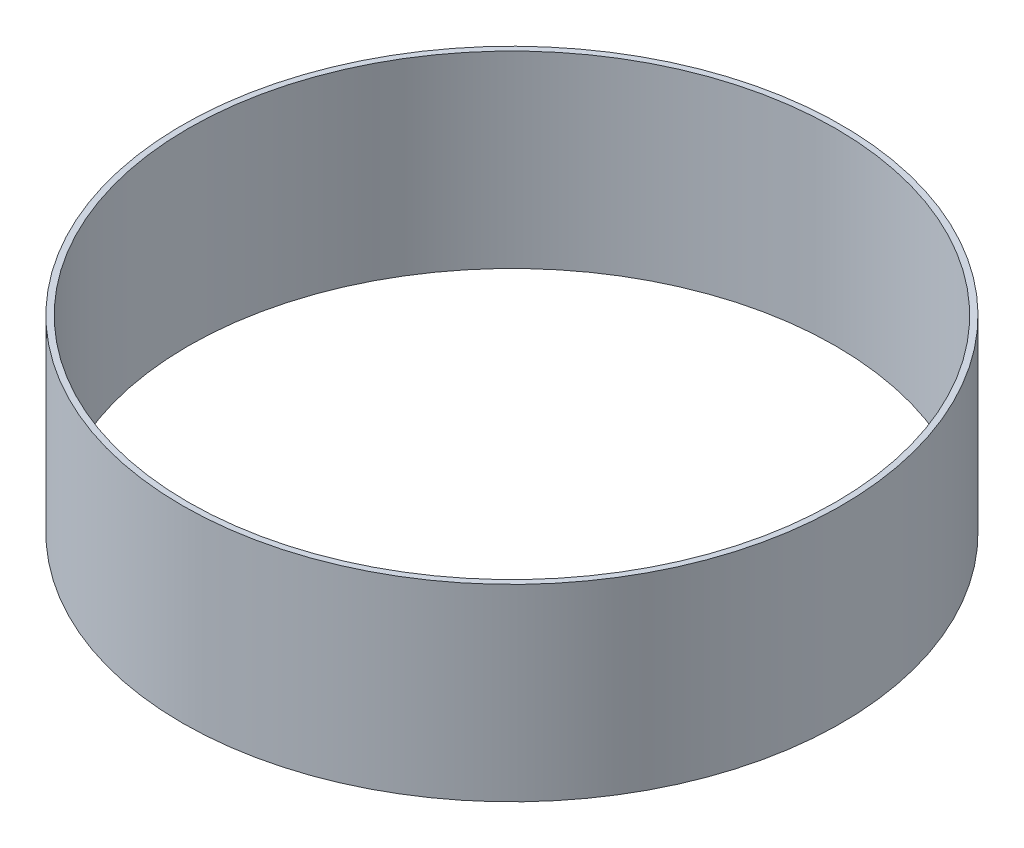
ISO-10303-21;
HEADER;
FILE_DESCRIPTION(('STEP AP214'),'2;1');
FILE_NAME('part.step','',(''),(''),'','','');
FILE_SCHEMA(('AUTOMOTIVE_DESIGN { 1 0 10303 214 1 1 1 1 }'));
ENDSEC;
DATA;
#1=APPLICATION_CONTEXT('core data for automotive mechanical design processes');
#2=APPLICATION_PROTOCOL_DEFINITION('international standard','automotive_design',2000,#1);
#3=PRODUCT_CONTEXT('',#1,'mechanical');
#4=PRODUCT('Part','Part','',(#3));
#5=PRODUCT_RELATED_PRODUCT_CATEGORY('part','',(#4));
#6=PRODUCT_DEFINITION_FORMATION('','',#4);
#7=PRODUCT_DEFINITION_CONTEXT('part definition',#1,'design');
#8=PRODUCT_DEFINITION('design','',#6,#7);
#9=PRODUCT_DEFINITION_SHAPE('','',#8);
#10=(LENGTH_UNIT() NAMED_UNIT(*) SI_UNIT(.MILLI.,.METRE.));
#11=(NAMED_UNIT(*) PLANE_ANGLE_UNIT() SI_UNIT($,.RADIAN.));
#12=(NAMED_UNIT(*) SI_UNIT($,.STERADIAN.) SOLID_ANGLE_UNIT());
#13=UNCERTAINTY_MEASURE_WITH_UNIT(LENGTH_MEASURE(1.E-05),#10,'distance_accuracy_value','');
#14=(GEOMETRIC_REPRESENTATION_CONTEXT(3) GLOBAL_UNCERTAINTY_ASSIGNED_CONTEXT((#13)) GLOBAL_UNIT_ASSIGNED_CONTEXT((#10,
#11,#12)) REPRESENTATION_CONTEXT('',''));
#15=CARTESIAN_POINT('',(0.,0.,0.));
#16=DIRECTION('',(0.,0.,1.));
#17=DIRECTION('',(1.,0.,0.));
#18=AXIS2_PLACEMENT_3D('',#15,#16,#17);
#19=CARTESIAN_POINT('',(0.,101.6,0.));
#20=DIRECTION('',(0.,1.,0.));
#21=DIRECTION('',(0.,0.,1.));
#22=AXIS2_PLACEMENT_3D('',#19,#20,#21);
#23=PLANE('',#22);
#24=CARTESIAN_POINT('',(0.,101.6,0.));
#25=DIRECTION('',(0.,1.,0.));
#26=DIRECTION('',(0.,0.,1.));
#27=AXIS2_PLACEMENT_3D('',#24,#25,#26);
#28=CIRCLE('',#27,177.8);
#29=CARTESIAN_POINT('',(0.,101.6,177.8));
#30=VERTEX_POINT('',#29);
#31=EDGE_CURVE('E10',#30,#30,#28,.T.);
#32=ORIENTED_EDGE('',*,*,#31,.T.);
#33=EDGE_LOOP('',(#32));
#34=FACE_BOUND('',#33,.T.);
#35=CARTESIAN_POINT('',(0.,101.6,0.));
#36=DIRECTION('',(0.,1.,0.));
#37=DIRECTION('',(0.,0.,1.));
#38=AXIS2_PLACEMENT_3D('',#35,#36,#37);
#39=CIRCLE('',#38,174.625);
#40=CARTESIAN_POINT('',(0.,101.6,174.625));
#41=VERTEX_POINT('',#40);
#42=EDGE_CURVE('E42',#41,#41,#39,.T.);
#43=ORIENTED_EDGE('',*,*,#42,.F.);
#44=EDGE_LOOP('',(#43));
#45=FACE_BOUND('',#44,.T.);
#46=ADVANCED_FACE('F31',(#34,#45),#23,.T.);
#47=CARTESIAN_POINT('',(0.,0.,0.));
#48=DIRECTION('',(0.,1.,0.));
#49=DIRECTION('',(0.,0.,1.));
#50=AXIS2_PLACEMENT_3D('',#47,#48,#49);
#51=PLANE('',#50);
#52=CARTESIAN_POINT('',(0.,0.,0.));
#53=DIRECTION('',(0.,1.,0.));
#54=DIRECTION('',(0.,0.,1.));
#55=AXIS2_PLACEMENT_3D('',#52,#53,#54);
#56=CIRCLE('',#55,177.8);
#57=CARTESIAN_POINT('',(0.,0.,177.8));
#58=VERTEX_POINT('',#57);
#59=EDGE_CURVE('E35',#58,#58,#56,.T.);
#60=ORIENTED_EDGE('',*,*,#59,.F.);
#61=EDGE_LOOP('',(#60));
#62=FACE_BOUND('',#61,.T.);
#63=CARTESIAN_POINT('',(0.,0.,0.));
#64=DIRECTION('',(0.,1.,0.));
#65=DIRECTION('',(0.,0.,1.));
#66=AXIS2_PLACEMENT_3D('',#63,#64,#65);
#67=CIRCLE('',#66,174.625);
#68=CARTESIAN_POINT('',(0.,0.,174.625));
#69=VERTEX_POINT('',#68);
#70=EDGE_CURVE('E44',#69,#69,#67,.T.);
#71=ORIENTED_EDGE('',*,*,#70,.T.);
#72=EDGE_LOOP('',(#71));
#73=FACE_BOUND('',#72,.T.);
#74=ADVANCED_FACE('F54',(#62,#73),#51,.F.);
#75=CARTESIAN_POINT('',(0.,101.6,0.));
#76=DIRECTION('',(0.,-1.,0.));
#77=DIRECTION('',(0.,0.,-1.));
#78=AXIS2_PLACEMENT_3D('',#75,#76,#77);
#79=CYLINDRICAL_SURFACE('',#78,177.8);
#80=ORIENTED_EDGE('',*,*,#31,.F.);
#81=EDGE_LOOP('',(#80));
#82=FACE_BOUND('',#81,.T.);
#83=ORIENTED_EDGE('',*,*,#59,.T.);
#84=EDGE_LOOP('',(#83));
#85=FACE_BOUND('',#84,.T.);
#86=ADVANCED_FACE('F33',(#82,#85),#79,.T.);
#87=CARTESIAN_POINT('',(0.,101.6,0.));
#88=DIRECTION('',(0.,-1.,0.));
#89=DIRECTION('',(0.,0.,-1.));
#90=AXIS2_PLACEMENT_3D('',#87,#88,#89);
#91=CYLINDRICAL_SURFACE('',#90,174.625);
#92=ORIENTED_EDGE('',*,*,#42,.T.);
#93=EDGE_LOOP('',(#92));
#94=FACE_BOUND('',#93,.T.);
#95=ORIENTED_EDGE('',*,*,#70,.F.);
#96=EDGE_LOOP('',(#95));
#97=FACE_BOUND('',#96,.T.);
#98=ADVANCED_FACE('F50',(#94,#97),#91,.F.);
#99=CLOSED_SHELL('',(#46,#74,#86,#98));
#100=MANIFOLD_SOLID_BREP('B2',#99);
#101=ADVANCED_BREP_SHAPE_REPRESENTATION('',(#18,#100),#14);
#102=SHAPE_DEFINITION_REPRESENTATION(#9,#101);
ENDSEC;
END-ISO-10303-21;
